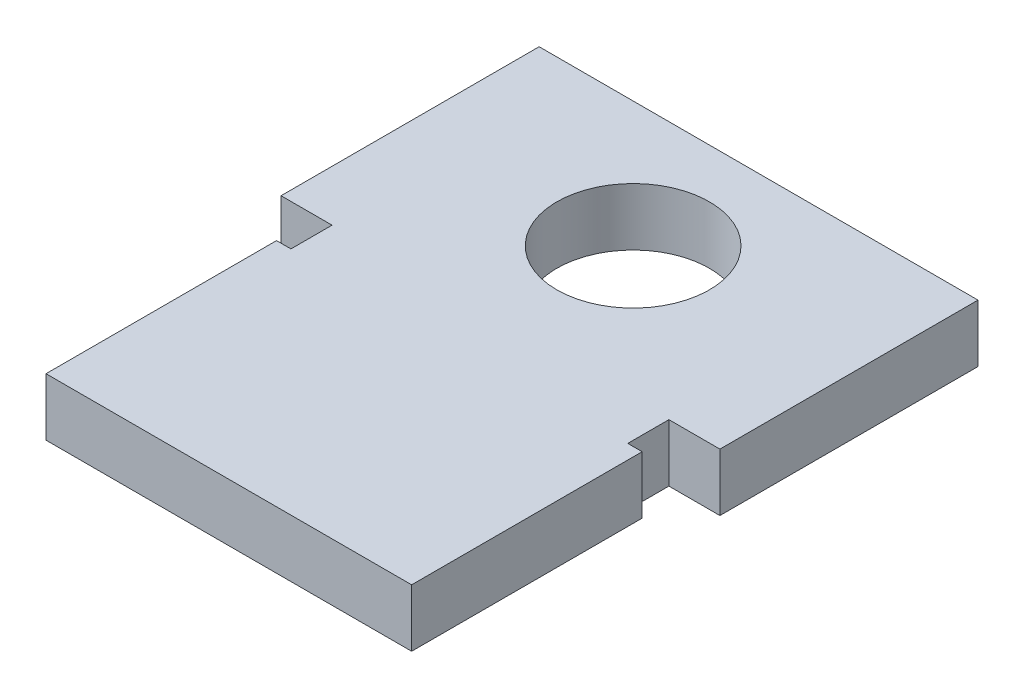
ISO-10303-21;
HEADER;
FILE_DESCRIPTION(('STEP AP214'),'2;1');
FILE_NAME('part.step','',(''),(''),'','','');
FILE_SCHEMA(('AUTOMOTIVE_DESIGN { 1 0 10303 214 1 1 1 1 }'));
ENDSEC;
DATA;
#1=APPLICATION_CONTEXT('core data for automotive mechanical design processes');
#2=APPLICATION_PROTOCOL_DEFINITION('international standard','automotive_design',2000,#1);
#3=PRODUCT_CONTEXT('',#1,'mechanical');
#4=PRODUCT('Part','Part','',(#3));
#5=PRODUCT_RELATED_PRODUCT_CATEGORY('part','',(#4));
#6=PRODUCT_DEFINITION_FORMATION('','',#4);
#7=PRODUCT_DEFINITION_CONTEXT('part definition',#1,'design');
#8=PRODUCT_DEFINITION('design','',#6,#7);
#9=PRODUCT_DEFINITION_SHAPE('','',#8);
#10=(LENGTH_UNIT() NAMED_UNIT(*) SI_UNIT(.MILLI.,.METRE.));
#11=(NAMED_UNIT(*) PLANE_ANGLE_UNIT() SI_UNIT($,.RADIAN.));
#12=(NAMED_UNIT(*) SI_UNIT($,.STERADIAN.) SOLID_ANGLE_UNIT());
#13=UNCERTAINTY_MEASURE_WITH_UNIT(LENGTH_MEASURE(1.E-05),#10,'distance_accuracy_value','');
#14=(GEOMETRIC_REPRESENTATION_CONTEXT(3) GLOBAL_UNCERTAINTY_ASSIGNED_CONTEXT((#13)) GLOBAL_UNIT_ASSIGNED_CONTEXT((#10,
#11,#12)) REPRESENTATION_CONTEXT('',''));
#15=CARTESIAN_POINT('',(0.,0.,0.));
#16=DIRECTION('',(0.,0.,1.));
#17=DIRECTION('',(1.,0.,0.));
#18=AXIS2_PLACEMENT_3D('',#15,#16,#17);
#19=CARTESIAN_POINT('',(0.,1.4,0.));
#20=DIRECTION('',(0.,1.,0.));
#21=DIRECTION('',(0.,0.,1.));
#22=AXIS2_PLACEMENT_3D('',#19,#20,#21);
#23=PLANE('',#22);
#24=CARTESIAN_POINT('',(0.,1.4,0.));
#25=DIRECTION('',(0.,1.,0.));
#26=DIRECTION('',(0.,0.,1.));
#27=AXIS2_PLACEMENT_3D('',#24,#25,#26);
#28=CIRCLE('',#27,1.855);
#29=CARTESIAN_POINT('',(0.,1.4,1.855));
#30=VERTEX_POINT('',#29);
#31=EDGE_CURVE('E224',#30,#30,#28,.T.);
#32=ORIENTED_EDGE('',*,*,#31,.F.);
#33=EDGE_LOOP('',(#32));
#34=FACE_BOUND('',#33,.T.);
#35=DIRECTION('',(0.,0.,-1.));
#36=VECTOR('',#35,1.);
#37=CARTESIAN_POINT('',(4.445,1.4,9.83));
#38=LINE('',#37,#36);
#39=CARTESIAN_POINT('',(4.445,1.4,9.83));
#40=VERTEX_POINT('',#39);
#41=CARTESIAN_POINT('',(4.445,1.4,4.225));
#42=VERTEX_POINT('',#41);
#43=EDGE_CURVE('E136',#40,#42,#38,.T.);
#44=ORIENTED_EDGE('',*,*,#43,.T.);
#45=DIRECTION('',(-1.,0.,0.));
#46=VECTOR('',#45,1.);
#47=CARTESIAN_POINT('',(4.445,1.4,4.225));
#48=LINE('',#47,#46);
#49=CARTESIAN_POINT('',(4.095,1.4,4.225));
#50=VERTEX_POINT('',#49);
#51=EDGE_CURVE('E148',#42,#50,#48,.T.);
#52=ORIENTED_EDGE('',*,*,#51,.T.);
#53=DIRECTION('',(0.,0.,-1.));
#54=VECTOR('',#53,1.);
#55=CARTESIAN_POINT('',(4.095,1.4,3.225));
#56=LINE('',#55,#54);
#57=CARTESIAN_POINT('',(4.095,1.4,3.225));
#58=VERTEX_POINT('',#57);
#59=EDGE_CURVE('E281',#50,#58,#56,.T.);
#60=ORIENTED_EDGE('',*,*,#59,.T.);
#61=DIRECTION('',(1.,0.,0.));
#62=VECTOR('',#61,1.);
#63=CARTESIAN_POINT('',(5.335,1.4,3.225));
#64=LINE('',#63,#62);
#65=CARTESIAN_POINT('',(5.335,1.4,3.225));
#66=VERTEX_POINT('',#65);
#67=EDGE_CURVE('E152',#58,#66,#64,.T.);
#68=ORIENTED_EDGE('',*,*,#67,.T.);
#69=DIRECTION('',(0.,0.,-1.));
#70=VECTOR('',#69,1.);
#71=CARTESIAN_POINT('',(5.335,1.4,-3.05));
#72=LINE('',#71,#70);
#73=CARTESIAN_POINT('',(5.335,1.4,-3.05));
#74=VERTEX_POINT('',#73);
#75=EDGE_CURVE('E241',#66,#74,#72,.T.);
#76=ORIENTED_EDGE('',*,*,#75,.T.);
#77=DIRECTION('',(-1.,0.,0.));
#78=VECTOR('',#77,1.);
#79=CARTESIAN_POINT('',(-5.335,1.4,-3.05));
#80=LINE('',#79,#78);
#81=CARTESIAN_POINT('',(-5.335,1.4,-3.05));
#82=VERTEX_POINT('',#81);
#83=EDGE_CURVE('E244',#74,#82,#80,.T.);
#84=ORIENTED_EDGE('',*,*,#83,.T.);
#85=DIRECTION('',(0.,0.,1.));
#86=VECTOR('',#85,1.);
#87=CARTESIAN_POINT('',(-5.335,1.4,-3.05));
#88=LINE('',#87,#86);
#89=CARTESIAN_POINT('',(-5.335,1.4,3.225));
#90=VERTEX_POINT('',#89);
#91=EDGE_CURVE('E232',#82,#90,#88,.T.);
#92=ORIENTED_EDGE('',*,*,#91,.T.);
#93=DIRECTION('',(-1.,0.,0.));
#94=VECTOR('',#93,1.);
#95=CARTESIAN_POINT('',(-5.335,1.4,3.225));
#96=LINE('',#95,#94);
#97=CARTESIAN_POINT('',(-4.095,1.4,3.225));
#98=VERTEX_POINT('',#97);
#99=EDGE_CURVE('E207',#98,#90,#96,.T.);
#100=ORIENTED_EDGE('',*,*,#99,.F.);
#101=DIRECTION('',(0.,0.,-1.));
#102=VECTOR('',#101,1.);
#103=CARTESIAN_POINT('',(-4.095,1.4,3.225));
#104=LINE('',#103,#102);
#105=CARTESIAN_POINT('',(-4.095,1.4,4.225));
#106=VERTEX_POINT('',#105);
#107=EDGE_CURVE('E167',#106,#98,#104,.T.);
#108=ORIENTED_EDGE('',*,*,#107,.F.);
#109=DIRECTION('',(1.,0.,0.));
#110=VECTOR('',#109,1.);
#111=CARTESIAN_POINT('',(-4.445,1.4,4.225));
#112=LINE('',#111,#110);
#113=CARTESIAN_POINT('',(-4.445,1.4,4.225));
#114=VERTEX_POINT('',#113);
#115=EDGE_CURVE('E172',#114,#106,#112,.T.);
#116=ORIENTED_EDGE('',*,*,#115,.F.);
#117=DIRECTION('',(0.,0.,-1.));
#118=VECTOR('',#117,1.);
#119=CARTESIAN_POINT('',(-4.445,1.4,9.83));
#120=LINE('',#119,#118);
#121=CARTESIAN_POINT('',(-4.445,1.4,9.83));
#122=VERTEX_POINT('',#121);
#123=EDGE_CURVE('E199',#122,#114,#120,.T.);
#124=ORIENTED_EDGE('',*,*,#123,.F.);
#125=DIRECTION('',(1.,0.,0.));
#126=VECTOR('',#125,1.);
#127=CARTESIAN_POINT('',(-5.335,1.4,9.83));
#128=LINE('',#127,#126);
#129=EDGE_CURVE('E236',#122,#40,#128,.T.);
#130=ORIENTED_EDGE('',*,*,#129,.T.);
#131=EDGE_LOOP('',(#44,#52,#60,#68,#76,#84,#92,#100,#108,#116,#124,#130));
#132=FACE_BOUND('',#131,.T.);
#133=ADVANCED_FACE('F38',(#34,#132),#23,.T.);
#134=CARTESIAN_POINT('',(0.,0.,0.));
#135=DIRECTION('',(0.,1.,0.));
#136=DIRECTION('',(0.,0.,1.));
#137=AXIS2_PLACEMENT_3D('',#134,#135,#136);
#138=PLANE('',#137);
#139=CARTESIAN_POINT('',(0.,0.,0.));
#140=DIRECTION('',(0.,1.,0.));
#141=DIRECTION('',(0.,0.,1.));
#142=AXIS2_PLACEMENT_3D('',#139,#140,#141);
#143=CIRCLE('',#142,1.855);
#144=CARTESIAN_POINT('',(0.,0.,1.855));
#145=VERTEX_POINT('',#144);
#146=EDGE_CURVE('E221',#145,#145,#143,.T.);
#147=ORIENTED_EDGE('',*,*,#146,.T.);
#148=EDGE_LOOP('',(#147));
#149=FACE_BOUND('',#148,.T.);
#150=DIRECTION('',(-1.,0.,0.));
#151=VECTOR('',#150,1.);
#152=CARTESIAN_POINT('',(4.445,0.,4.225));
#153=LINE('',#152,#151);
#154=CARTESIAN_POINT('',(4.445,0.,4.225));
#155=VERTEX_POINT('',#154);
#156=CARTESIAN_POINT('',(4.095,0.,4.225));
#157=VERTEX_POINT('',#156);
#158=EDGE_CURVE('E147',#155,#157,#153,.T.);
#159=ORIENTED_EDGE('',*,*,#158,.F.);
#160=DIRECTION('',(0.,0.,-1.));
#161=VECTOR('',#160,1.);
#162=CARTESIAN_POINT('',(4.445,0.,9.83));
#163=LINE('',#162,#161);
#164=CARTESIAN_POINT('',(4.445,0.,9.83));
#165=VERTEX_POINT('',#164);
#166=EDGE_CURVE('E135',#165,#155,#163,.T.);
#167=ORIENTED_EDGE('',*,*,#166,.F.);
#168=DIRECTION('',(1.,0.,0.));
#169=VECTOR('',#168,1.);
#170=CARTESIAN_POINT('',(-5.335,0.,9.83));
#171=LINE('',#170,#169);
#172=CARTESIAN_POINT('',(-4.445,0.,9.83));
#173=VERTEX_POINT('',#172);
#174=EDGE_CURVE('E250',#173,#165,#171,.T.);
#175=ORIENTED_EDGE('',*,*,#174,.F.);
#176=DIRECTION('',(0.,0.,-1.));
#177=VECTOR('',#176,1.);
#178=CARTESIAN_POINT('',(-4.445,0.,9.83));
#179=LINE('',#178,#177);
#180=CARTESIAN_POINT('',(-4.445,0.,4.225));
#181=VERTEX_POINT('',#180);
#182=EDGE_CURVE('E202',#173,#181,#179,.T.);
#183=ORIENTED_EDGE('',*,*,#182,.T.);
#184=DIRECTION('',(1.,0.,0.));
#185=VECTOR('',#184,1.);
#186=CARTESIAN_POINT('',(-4.445,0.,4.225));
#187=LINE('',#186,#185);
#188=CARTESIAN_POINT('',(-4.095,0.,4.225));
#189=VERTEX_POINT('',#188);
#190=EDGE_CURVE('E54',#181,#189,#187,.T.);
#191=ORIENTED_EDGE('',*,*,#190,.T.);
#192=DIRECTION('',(0.,0.,-1.));
#193=VECTOR('',#192,1.);
#194=CARTESIAN_POINT('',(-4.095,0.,3.225));
#195=LINE('',#194,#193);
#196=CARTESIAN_POINT('',(-4.095,0.,3.225));
#197=VERTEX_POINT('',#196);
#198=EDGE_CURVE('E166',#189,#197,#195,.T.);
#199=ORIENTED_EDGE('',*,*,#198,.T.);
#200=DIRECTION('',(-1.,0.,0.));
#201=VECTOR('',#200,1.);
#202=CARTESIAN_POINT('',(-5.335,0.,3.225));
#203=LINE('',#202,#201);
#204=CARTESIAN_POINT('',(-5.335,0.,3.225));
#205=VERTEX_POINT('',#204);
#206=EDGE_CURVE('E206',#197,#205,#203,.T.);
#207=ORIENTED_EDGE('',*,*,#206,.T.);
#208=DIRECTION('',(0.,0.,1.));
#209=VECTOR('',#208,1.);
#210=CARTESIAN_POINT('',(-5.335,0.,-3.05));
#211=LINE('',#210,#209);
#212=CARTESIAN_POINT('',(-5.335,0.,-3.05));
#213=VERTEX_POINT('',#212);
#214=EDGE_CURVE('E228',#213,#205,#211,.T.);
#215=ORIENTED_EDGE('',*,*,#214,.F.);
#216=DIRECTION('',(-1.,0.,0.));
#217=VECTOR('',#216,1.);
#218=CARTESIAN_POINT('',(-5.335,0.,-3.05));
#219=LINE('',#218,#217);
#220=CARTESIAN_POINT('',(5.335,0.,-3.05));
#221=VERTEX_POINT('',#220);
#222=EDGE_CURVE('E237',#221,#213,#219,.T.);
#223=ORIENTED_EDGE('',*,*,#222,.F.);
#224=DIRECTION('',(0.,0.,-1.));
#225=VECTOR('',#224,1.);
#226=CARTESIAN_POINT('',(5.335,0.,-3.05));
#227=LINE('',#226,#225);
#228=CARTESIAN_POINT('',(5.335,0.,3.225));
#229=VERTEX_POINT('',#228);
#230=EDGE_CURVE('E133',#229,#221,#227,.T.);
#231=ORIENTED_EDGE('',*,*,#230,.F.);
#232=DIRECTION('',(1.,0.,0.));
#233=VECTOR('',#232,1.);
#234=CARTESIAN_POINT('',(5.335,0.,3.225));
#235=LINE('',#234,#233);
#236=CARTESIAN_POINT('',(4.095,0.,3.225));
#237=VERTEX_POINT('',#236);
#238=EDGE_CURVE('E62',#237,#229,#235,.T.);
#239=ORIENTED_EDGE('',*,*,#238,.F.);
#240=DIRECTION('',(0.,0.,-1.));
#241=VECTOR('',#240,1.);
#242=CARTESIAN_POINT('',(4.095,0.,3.225));
#243=LINE('',#242,#241);
#244=EDGE_CURVE('E131',#157,#237,#243,.T.);
#245=ORIENTED_EDGE('',*,*,#244,.F.);
#246=EDGE_LOOP('',(#159,#167,#175,#183,#191,#199,#207,#215,#223,#231,#239,#245));
#247=FACE_BOUND('',#246,.T.);
#248=ADVANCED_FACE('F130',(#149,#247),#138,.F.);
#249=CARTESIAN_POINT('',(4.445,0.,9.83));
#250=DIRECTION('',(1.,0.,0.));
#251=DIRECTION('',(0.,0.,-1.));
#252=AXIS2_PLACEMENT_3D('',#249,#250,#251);
#253=PLANE('',#252);
#254=ORIENTED_EDGE('',*,*,#166,.T.);
#255=DIRECTION('',(0.,1.,0.));
#256=VECTOR('',#255,1.);
#257=CARTESIAN_POINT('',(4.445,0.,4.225));
#258=LINE('',#257,#256);
#259=EDGE_CURVE('E158',#155,#42,#258,.T.);
#260=ORIENTED_EDGE('',*,*,#259,.T.);
#261=ORIENTED_EDGE('',*,*,#43,.F.);
#262=DIRECTION('',(0.,1.,0.));
#263=VECTOR('',#262,1.);
#264=CARTESIAN_POINT('',(4.445,0.,9.83));
#265=LINE('',#264,#263);
#266=EDGE_CURVE('E196',#165,#40,#265,.T.);
#267=ORIENTED_EDGE('',*,*,#266,.F.);
#268=EDGE_LOOP('',(#254,#260,#261,#267));
#269=FACE_BOUND('',#268,.T.);
#270=ADVANCED_FACE('F289',(#269),#253,.T.);
#271=CARTESIAN_POINT('',(-5.335,1.4,9.83));
#272=DIRECTION('',(0.,0.,-1.));
#273=DIRECTION('',(-1.,0.,0.));
#274=AXIS2_PLACEMENT_3D('',#271,#272,#273);
#275=PLANE('',#274);
#276=ORIENTED_EDGE('',*,*,#266,.T.);
#277=ORIENTED_EDGE('',*,*,#129,.F.);
#278=DIRECTION('',(0.,1.,0.));
#279=VECTOR('',#278,1.);
#280=CARTESIAN_POINT('',(-4.445,0.,9.83));
#281=LINE('',#280,#279);
#282=EDGE_CURVE('E211',#173,#122,#281,.T.);
#283=ORIENTED_EDGE('',*,*,#282,.F.);
#284=ORIENTED_EDGE('',*,*,#174,.T.);
#285=EDGE_LOOP('',(#276,#277,#283,#284));
#286=FACE_BOUND('',#285,.T.);
#287=ADVANCED_FACE('F295',(#286),#275,.F.);
#288=CARTESIAN_POINT('',(5.335,1.4,-3.05));
#289=DIRECTION('',(-1.,0.,0.));
#290=DIRECTION('',(0.,0.,1.));
#291=AXIS2_PLACEMENT_3D('',#288,#289,#290);
#292=PLANE('',#291);
#293=DIRECTION('',(0.,1.,0.));
#294=VECTOR('',#293,1.);
#295=CARTESIAN_POINT('',(5.335,0.,3.225));
#296=LINE('',#295,#294);
#297=EDGE_CURVE('E191',#229,#66,#296,.T.);
#298=ORIENTED_EDGE('',*,*,#297,.F.);
#299=ORIENTED_EDGE('',*,*,#230,.T.);
#300=DIRECTION('',(0.,-1.,0.));
#301=VECTOR('',#300,1.);
#302=CARTESIAN_POINT('',(5.335,1.4,-3.05));
#303=LINE('',#302,#301);
#304=EDGE_CURVE('E11',#74,#221,#303,.T.);
#305=ORIENTED_EDGE('',*,*,#304,.F.);
#306=ORIENTED_EDGE('',*,*,#75,.F.);
#307=EDGE_LOOP('',(#298,#299,#305,#306));
#308=FACE_BOUND('',#307,.T.);
#309=ADVANCED_FACE('F279',(#308),#292,.F.);
#310=CARTESIAN_POINT('',(-5.335,1.4,-3.05));
#311=DIRECTION('',(1.,0.,0.));
#312=DIRECTION('',(0.,0.,-1.));
#313=AXIS2_PLACEMENT_3D('',#310,#311,#312);
#314=PLANE('',#313);
#315=ORIENTED_EDGE('',*,*,#214,.T.);
#316=DIRECTION('',(0.,1.,0.));
#317=VECTOR('',#316,1.);
#318=CARTESIAN_POINT('',(-5.335,0.,3.225));
#319=LINE('',#318,#317);
#320=EDGE_CURVE('E217',#205,#90,#319,.T.);
#321=ORIENTED_EDGE('',*,*,#320,.T.);
#322=ORIENTED_EDGE('',*,*,#91,.F.);
#323=DIRECTION('',(0.,-1.,0.));
#324=VECTOR('',#323,1.);
#325=CARTESIAN_POINT('',(-5.335,1.4,-3.05));
#326=LINE('',#325,#324);
#327=EDGE_CURVE('E47',#82,#213,#326,.T.);
#328=ORIENTED_EDGE('',*,*,#327,.T.);
#329=EDGE_LOOP('',(#315,#321,#322,#328));
#330=FACE_BOUND('',#329,.T.);
#331=ADVANCED_FACE('F40',(#330),#314,.F.);
#332=CARTESIAN_POINT('',(-5.335,1.4,-3.05));
#333=DIRECTION('',(0.,0.,1.));
#334=DIRECTION('',(1.,0.,0.));
#335=AXIS2_PLACEMENT_3D('',#332,#333,#334);
#336=PLANE('',#335);
#337=ORIENTED_EDGE('',*,*,#222,.T.);
#338=ORIENTED_EDGE('',*,*,#327,.F.);
#339=ORIENTED_EDGE('',*,*,#83,.F.);
#340=ORIENTED_EDGE('',*,*,#304,.T.);
#341=EDGE_LOOP('',(#337,#338,#339,#340));
#342=FACE_BOUND('',#341,.T.);
#343=ADVANCED_FACE('F277',(#342),#336,.F.);
#344=CARTESIAN_POINT('',(0.,1.4,0.));
#345=DIRECTION('',(0.,-1.,0.));
#346=DIRECTION('',(0.,0.,-1.));
#347=AXIS2_PLACEMENT_3D('',#344,#345,#346);
#348=CYLINDRICAL_SURFACE('',#347,1.855);
#349=ORIENTED_EDGE('',*,*,#31,.T.);
#350=EDGE_LOOP('',(#349));
#351=FACE_BOUND('',#350,.T.);
#352=ORIENTED_EDGE('',*,*,#146,.F.);
#353=EDGE_LOOP('',(#352));
#354=FACE_BOUND('',#353,.T.);
#355=ADVANCED_FACE('F317',(#351,#354),#348,.F.);
#356=CARTESIAN_POINT('',(-5.335,0.,3.225));
#357=DIRECTION('',(0.,0.,-1.));
#358=DIRECTION('',(-1.,0.,0.));
#359=AXIS2_PLACEMENT_3D('',#356,#357,#358);
#360=PLANE('',#359);
#361=ORIENTED_EDGE('',*,*,#99,.T.);
#362=ORIENTED_EDGE('',*,*,#320,.F.);
#363=ORIENTED_EDGE('',*,*,#206,.F.);
#364=DIRECTION('',(0.,1.,0.));
#365=VECTOR('',#364,1.);
#366=CARTESIAN_POINT('',(-4.095,0.,3.225));
#367=LINE('',#366,#365);
#368=EDGE_CURVE('E179',#197,#98,#367,.T.);
#369=ORIENTED_EDGE('',*,*,#368,.T.);
#370=EDGE_LOOP('',(#361,#362,#363,#369));
#371=FACE_BOUND('',#370,.T.);
#372=ADVANCED_FACE('F268',(#371),#360,.F.);
#373=CARTESIAN_POINT('',(-4.445,0.,9.83));
#374=DIRECTION('',(1.,0.,0.));
#375=DIRECTION('',(0.,0.,-1.));
#376=AXIS2_PLACEMENT_3D('',#373,#374,#375);
#377=PLANE('',#376);
#378=ORIENTED_EDGE('',*,*,#123,.T.);
#379=DIRECTION('',(0.,1.,0.));
#380=VECTOR('',#379,1.);
#381=CARTESIAN_POINT('',(-4.445,0.,4.225));
#382=LINE('',#381,#380);
#383=EDGE_CURVE('E171',#181,#114,#382,.T.);
#384=ORIENTED_EDGE('',*,*,#383,.F.);
#385=ORIENTED_EDGE('',*,*,#182,.F.);
#386=ORIENTED_EDGE('',*,*,#282,.T.);
#387=EDGE_LOOP('',(#378,#384,#385,#386));
#388=FACE_BOUND('',#387,.T.);
#389=ADVANCED_FACE('F334',(#388),#377,.F.);
#390=CARTESIAN_POINT('',(5.335,0.,3.225));
#391=DIRECTION('',(0.,0.,1.));
#392=DIRECTION('',(1.,0.,0.));
#393=AXIS2_PLACEMENT_3D('',#390,#391,#392);
#394=PLANE('',#393);
#395=ORIENTED_EDGE('',*,*,#67,.F.);
#396=DIRECTION('',(0.,1.,0.));
#397=VECTOR('',#396,1.);
#398=CARTESIAN_POINT('',(4.095,0.,3.225));
#399=LINE('',#398,#397);
#400=EDGE_CURVE('E143',#237,#58,#399,.T.);
#401=ORIENTED_EDGE('',*,*,#400,.F.);
#402=ORIENTED_EDGE('',*,*,#238,.T.);
#403=ORIENTED_EDGE('',*,*,#297,.T.);
#404=EDGE_LOOP('',(#395,#401,#402,#403));
#405=FACE_BOUND('',#404,.T.);
#406=ADVANCED_FACE('F150',(#405),#394,.T.);
#407=CARTESIAN_POINT('',(-4.095,0.,3.225));
#408=DIRECTION('',(1.,0.,0.));
#409=DIRECTION('',(0.,0.,-1.));
#410=AXIS2_PLACEMENT_3D('',#407,#408,#409);
#411=PLANE('',#410);
#412=ORIENTED_EDGE('',*,*,#107,.T.);
#413=ORIENTED_EDGE('',*,*,#368,.F.);
#414=ORIENTED_EDGE('',*,*,#198,.F.);
#415=DIRECTION('',(0.,1.,0.));
#416=VECTOR('',#415,1.);
#417=CARTESIAN_POINT('',(-4.095,0.,4.225));
#418=LINE('',#417,#416);
#419=EDGE_CURVE('E183',#189,#106,#418,.T.);
#420=ORIENTED_EDGE('',*,*,#419,.T.);
#421=EDGE_LOOP('',(#412,#413,#414,#420));
#422=FACE_BOUND('',#421,.T.);
#423=ADVANCED_FACE('F270',(#422),#411,.F.);
#424=CARTESIAN_POINT('',(-4.445,0.,4.225));
#425=DIRECTION('',(0.,0.,1.));
#426=DIRECTION('',(1.,0.,0.));
#427=AXIS2_PLACEMENT_3D('',#424,#425,#426);
#428=PLANE('',#427);
#429=ORIENTED_EDGE('',*,*,#115,.T.);
#430=ORIENTED_EDGE('',*,*,#419,.F.);
#431=ORIENTED_EDGE('',*,*,#190,.F.);
#432=ORIENTED_EDGE('',*,*,#383,.T.);
#433=EDGE_LOOP('',(#429,#430,#431,#432));
#434=FACE_BOUND('',#433,.T.);
#435=ADVANCED_FACE('F299',(#434),#428,.F.);
#436=CARTESIAN_POINT('',(4.445,0.,4.225));
#437=DIRECTION('',(0.,0.,-1.));
#438=DIRECTION('',(-1.,0.,0.));
#439=AXIS2_PLACEMENT_3D('',#436,#437,#438);
#440=PLANE('',#439);
#441=ORIENTED_EDGE('',*,*,#51,.F.);
#442=ORIENTED_EDGE('',*,*,#259,.F.);
#443=ORIENTED_EDGE('',*,*,#158,.T.);
#444=DIRECTION('',(0.,1.,0.));
#445=VECTOR('',#444,1.);
#446=CARTESIAN_POINT('',(4.095,0.,4.225));
#447=LINE('',#446,#445);
#448=EDGE_CURVE('E145',#157,#50,#447,.T.);
#449=ORIENTED_EDGE('',*,*,#448,.T.);
#450=EDGE_LOOP('',(#441,#442,#443,#449));
#451=FACE_BOUND('',#450,.T.);
#452=ADVANCED_FACE('F297',(#451),#440,.T.);
#453=CARTESIAN_POINT('',(4.095,0.,3.225));
#454=DIRECTION('',(1.,0.,0.));
#455=DIRECTION('',(0.,0.,-1.));
#456=AXIS2_PLACEMENT_3D('',#453,#454,#455);
#457=PLANE('',#456);
#458=ORIENTED_EDGE('',*,*,#59,.F.);
#459=ORIENTED_EDGE('',*,*,#448,.F.);
#460=ORIENTED_EDGE('',*,*,#244,.T.);
#461=ORIENTED_EDGE('',*,*,#400,.T.);
#462=EDGE_LOOP('',(#458,#459,#460,#461));
#463=FACE_BOUND('',#462,.T.);
#464=ADVANCED_FACE('F142',(#463),#457,.T.);
#465=CLOSED_SHELL('',(#133,#248,#270,#287,#309,#331,#343,#355,#372,#389,#406,#423,#435,#452,#464));
#466=MANIFOLD_SOLID_BREP('B2',#465);
#467=ADVANCED_BREP_SHAPE_REPRESENTATION('',(#18,#466),#14);
#468=SHAPE_DEFINITION_REPRESENTATION(#9,#467);
ENDSEC;
END-ISO-10303-21;
